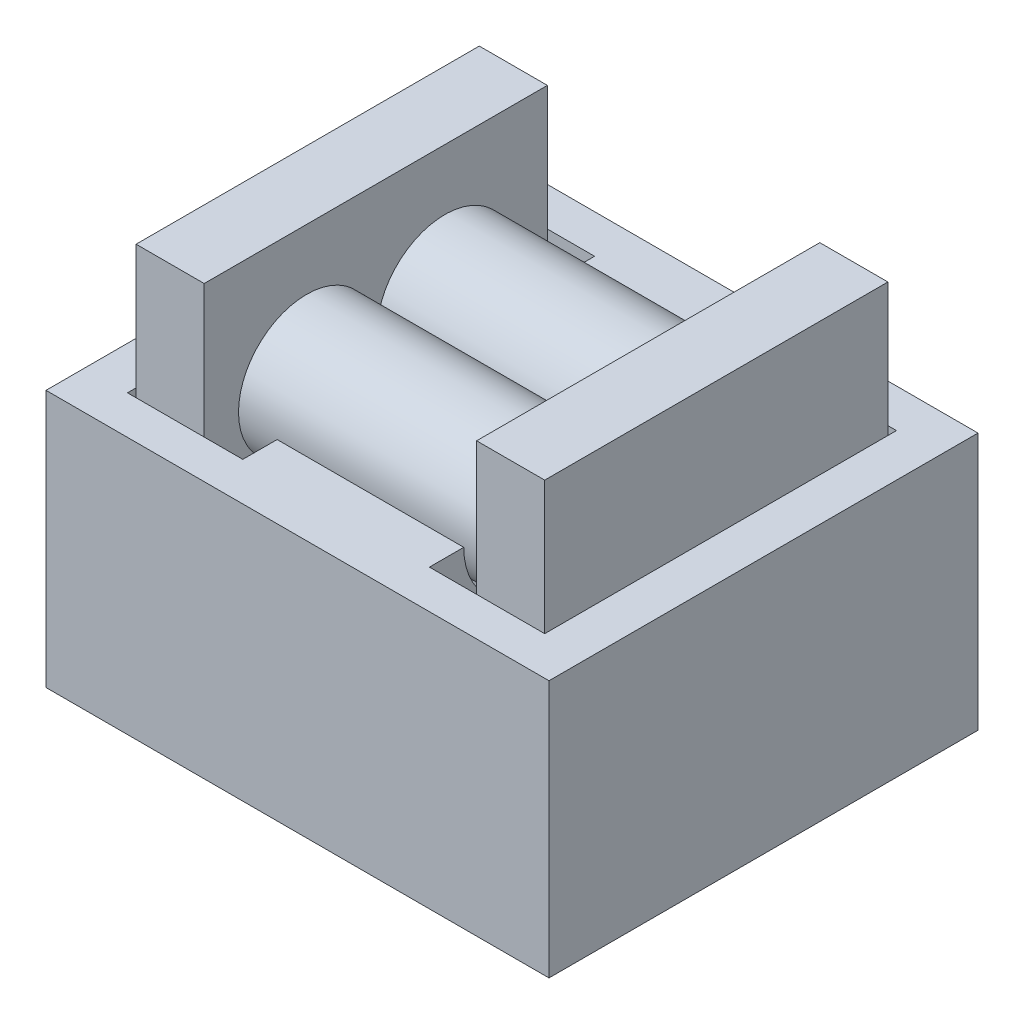
ISO-10303-21;
HEADER;
FILE_DESCRIPTION(('STEP AP214'),'2;1');
FILE_NAME('part.step','',(''),(''),'','','');
FILE_SCHEMA(('AUTOMOTIVE_DESIGN { 1 0 10303 214 1 1 1 1 }'));
ENDSEC;
DATA;
#1=APPLICATION_CONTEXT('core data for automotive mechanical design processes');
#2=APPLICATION_PROTOCOL_DEFINITION('international standard','automotive_design',2000,#1);
#3=PRODUCT_CONTEXT('',#1,'mechanical');
#4=PRODUCT('Part','Part','',(#3));
#5=PRODUCT_RELATED_PRODUCT_CATEGORY('part','',(#4));
#6=PRODUCT_DEFINITION_FORMATION('','',#4);
#7=PRODUCT_DEFINITION_CONTEXT('part definition',#1,'design');
#8=PRODUCT_DEFINITION('design','',#6,#7);
#9=PRODUCT_DEFINITION_SHAPE('','',#8);
#10=(LENGTH_UNIT() NAMED_UNIT(*) SI_UNIT(.MILLI.,.METRE.));
#11=(NAMED_UNIT(*) PLANE_ANGLE_UNIT() SI_UNIT($,.RADIAN.));
#12=(NAMED_UNIT(*) SI_UNIT($,.STERADIAN.) SOLID_ANGLE_UNIT());
#13=UNCERTAINTY_MEASURE_WITH_UNIT(LENGTH_MEASURE(1.E-05),#10,'distance_accuracy_value','');
#14=(GEOMETRIC_REPRESENTATION_CONTEXT(3) GLOBAL_UNCERTAINTY_ASSIGNED_CONTEXT((#13)) GLOBAL_UNIT_ASSIGNED_CONTEXT((#10,
#11,#12)) REPRESENTATION_CONTEXT('',''));
#15=CARTESIAN_POINT('',(0.,0.,0.));
#16=DIRECTION('',(0.,0.,1.));
#17=DIRECTION('',(1.,0.,0.));
#18=AXIS2_PLACEMENT_3D('',#15,#16,#17);
#19=CARTESIAN_POINT('',(-1.,8.,0.));
#20=DIRECTION('',(1.,0.,0.));
#21=DIRECTION('',(0.,0.,-1.));
#22=AXIS2_PLACEMENT_3D('',#19,#20,#21);
#23=PLANE('',#22);
#24=DIRECTION('',(0.,-1.,0.));
#25=VECTOR('',#24,1.);
#26=CARTESIAN_POINT('',(-1.,8.,-8.1));
#27=LINE('',#26,#25);
#28=CARTESIAN_POINT('',(-1.,5.,-8.1));
#29=VERTEX_POINT('',#28);
#30=CARTESIAN_POINT('',(-1.,3.,-8.1));
#31=VERTEX_POINT('',#30);
#32=EDGE_CURVE('E78',#29,#31,#27,.T.);
#33=ORIENTED_EDGE('',*,*,#32,.F.);
#34=DIRECTION('',(0.,0.,-1.));
#35=VECTOR('',#34,1.);
#36=CARTESIAN_POINT('',(-1.,5.,-7.3));
#37=LINE('',#36,#35);
#38=CARTESIAN_POINT('',(-1.,5.,-7.3));
#39=VERTEX_POINT('',#38);
#40=EDGE_CURVE('E355',#39,#29,#37,.T.);
#41=ORIENTED_EDGE('',*,*,#40,.F.);
#42=CARTESIAN_POINT('',(-1.,5.,-5.6125));
#43=DIRECTION('',(1.,0.,0.));
#44=DIRECTION('',(0.,0.,-1.));
#45=AXIS2_PLACEMENT_3D('',#42,#43,#44);
#46=CIRCLE('',#45,1.6875);
#47=CARTESIAN_POINT('',(-1.,4.50250628144669,-4.));
#48=VERTEX_POINT('',#47);
#49=EDGE_CURVE('E367',#48,#39,#46,.T.);
#50=ORIENTED_EDGE('',*,*,#49,.F.);
#51=CARTESIAN_POINT('',(-1.,5.,-2.3875));
#52=DIRECTION('',(1.,0.,0.));
#53=DIRECTION('',(0.,0.,-1.));
#54=AXIS2_PLACEMENT_3D('',#51,#52,#53);
#55=CIRCLE('',#54,1.6875);
#56=CARTESIAN_POINT('',(-1.,5.,-0.699999999999999));
#57=VERTEX_POINT('',#56);
#58=EDGE_CURVE('E372',#57,#48,#55,.T.);
#59=ORIENTED_EDGE('',*,*,#58,.F.);
#60=DIRECTION('',(0.,0.,-1.));
#61=VECTOR('',#60,1.);
#62=CARTESIAN_POINT('',(-1.,5.,-0.699999999999999));
#63=LINE('',#62,#61);
#64=CARTESIAN_POINT('',(-1.,5.,0.0999999999999994));
#65=VERTEX_POINT('',#64);
#66=EDGE_CURVE('E377',#65,#57,#63,.T.);
#67=ORIENTED_EDGE('',*,*,#66,.F.);
#68=DIRECTION('',(0.,1.,0.));
#69=VECTOR('',#68,1.);
#70=CARTESIAN_POINT('',(-1.,8.,0.099999999999999));
#71=LINE('',#70,#69);
#72=CARTESIAN_POINT('',(-1.,3.,0.0999999999999996));
#73=VERTEX_POINT('',#72);
#74=EDGE_CURVE('E260',#73,#65,#71,.T.);
#75=ORIENTED_EDGE('',*,*,#74,.F.);
#76=DIRECTION('',(0.,0.,-1.));
#77=VECTOR('',#76,1.);
#78=CARTESIAN_POINT('',(-1.,3.,0.));
#79=LINE('',#78,#77);
#80=EDGE_CURVE('E343',#73,#31,#79,.T.);
#81=ORIENTED_EDGE('',*,*,#80,.T.);
#82=EDGE_LOOP('',(#33,#41,#50,#59,#67,#75,#81));
#83=FACE_BOUND('',#82,.T.);
#84=ADVANCED_FACE('F55',(#83),#23,.T.);
#85=CARTESIAN_POINT('',(-5.35,0.,0.));
#86=DIRECTION('',(-1.,0.,0.));
#87=DIRECTION('',(0.,0.,1.));
#88=AXIS2_PLACEMENT_3D('',#85,#86,#87);
#89=PLANE('',#88);
#90=DIRECTION('',(0.,1.,0.));
#91=VECTOR('',#90,1.);
#92=CARTESIAN_POINT('',(-5.35,0.,-8.1));
#93=LINE('',#92,#91);
#94=CARTESIAN_POINT('',(-5.35,3.,-8.1));
#95=VERTEX_POINT('',#94);
#96=CARTESIAN_POINT('',(-5.35,5.,-8.1));
#97=VERTEX_POINT('',#96);
#98=EDGE_CURVE('E264',#95,#97,#93,.T.);
#99=ORIENTED_EDGE('',*,*,#98,.F.);
#100=DIRECTION('',(0.,0.,1.));
#101=VECTOR('',#100,1.);
#102=CARTESIAN_POINT('',(-5.35,3.,0.));
#103=LINE('',#102,#101);
#104=CARTESIAN_POINT('',(-5.35,3.,0.0999999999999996));
#105=VERTEX_POINT('',#104);
#106=EDGE_CURVE('E13',#95,#105,#103,.T.);
#107=ORIENTED_EDGE('',*,*,#106,.T.);
#108=DIRECTION('',(0.,-1.,0.));
#109=VECTOR('',#108,1.);
#110=CARTESIAN_POINT('',(-5.35,0.,0.1));
#111=LINE('',#110,#109);
#112=CARTESIAN_POINT('',(-5.35,5.,0.0999999999999994));
#113=VERTEX_POINT('',#112);
#114=EDGE_CURVE('E255',#113,#105,#111,.T.);
#115=ORIENTED_EDGE('',*,*,#114,.F.);
#116=DIRECTION('',(0.,0.,-1.));
#117=VECTOR('',#116,1.);
#118=CARTESIAN_POINT('',(-5.35,5.,-0.699999999999999));
#119=LINE('',#118,#117);
#120=CARTESIAN_POINT('',(-5.35,5.,-0.699999999999999));
#121=VERTEX_POINT('',#120);
#122=EDGE_CURVE('E352',#113,#121,#119,.T.);
#123=ORIENTED_EDGE('',*,*,#122,.T.);
#124=CARTESIAN_POINT('',(-5.35,5.,-2.3875));
#125=DIRECTION('',(-1.,0.,0.));
#126=DIRECTION('',(0.,0.,1.));
#127=AXIS2_PLACEMENT_3D('',#124,#125,#126);
#128=CIRCLE('',#127,1.6875);
#129=CARTESIAN_POINT('',(-5.35,4.50250628144669,-4.));
#130=VERTEX_POINT('',#129);
#131=EDGE_CURVE('E351',#121,#130,#128,.F.);
#132=ORIENTED_EDGE('',*,*,#131,.T.);
#133=CARTESIAN_POINT('',(-5.35,5.,-5.6125));
#134=DIRECTION('',(-1.,0.,0.));
#135=DIRECTION('',(0.,0.,1.));
#136=AXIS2_PLACEMENT_3D('',#133,#134,#135);
#137=CIRCLE('',#136,1.6875);
#138=CARTESIAN_POINT('',(-5.35,5.,-7.3));
#139=VERTEX_POINT('',#138);
#140=EDGE_CURVE('E358',#130,#139,#137,.F.);
#141=ORIENTED_EDGE('',*,*,#140,.T.);
#142=DIRECTION('',(0.,0.,-1.));
#143=VECTOR('',#142,1.);
#144=CARTESIAN_POINT('',(-5.35,5.,-7.3));
#145=LINE('',#144,#143);
#146=EDGE_CURVE('E70',#139,#97,#145,.T.);
#147=ORIENTED_EDGE('',*,*,#146,.T.);
#148=EDGE_LOOP('',(#99,#107,#115,#123,#132,#141,#147));
#149=FACE_BOUND('',#148,.T.);
#150=ADVANCED_FACE('F401',(#149),#89,.T.);
#151=CARTESIAN_POINT('',(11.1803398874989,5.,-7.3));
#152=DIRECTION('',(0.,1.,0.));
#153=DIRECTION('',(0.,0.,1.));
#154=AXIS2_PLACEMENT_3D('',#151,#152,#153);
#155=PLANE('',#154);
#156=ORIENTED_EDGE('',*,*,#40,.T.);
#157=DIRECTION('',(-1.,0.,0.));
#158=VECTOR('',#157,1.);
#159=CARTESIAN_POINT('',(-8.0375,5.00000000000001,-8.1));
#160=LINE('',#159,#158);
#161=CARTESIAN_POINT('',(1.6875,5.00000000000001,-8.1));
#162=VERTEX_POINT('',#161);
#163=EDGE_CURVE('E251',#162,#29,#160,.T.);
#164=ORIENTED_EDGE('',*,*,#163,.F.);
#165=DIRECTION('',(0.,0.,-1.));
#166=VECTOR('',#165,1.);
#167=CARTESIAN_POINT('',(1.6875,5.,0.0999999999999897));
#168=LINE('',#167,#166);
#169=CARTESIAN_POINT('',(1.6875,5.,0.0999999999999996));
#170=VERTEX_POINT('',#169);
#171=EDGE_CURVE('E223',#170,#162,#168,.T.);
#172=ORIENTED_EDGE('',*,*,#171,.F.);
#173=DIRECTION('',(1.,0.,0.));
#174=VECTOR('',#173,1.);
#175=CARTESIAN_POINT('',(-8.0375,5.,0.0999999999999994));
#176=LINE('',#175,#174);
#177=EDGE_CURVE('E227',#65,#170,#176,.T.);
#178=ORIENTED_EDGE('',*,*,#177,.F.);
#179=ORIENTED_EDGE('',*,*,#66,.T.);
#180=DIRECTION('',(-1.,0.,0.));
#181=VECTOR('',#180,1.);
#182=CARTESIAN_POINT('',(11.1803398874989,5.,-0.699999999999999));
#183=LINE('',#182,#181);
#184=EDGE_CURVE('E376',#57,#121,#183,.T.);
#185=ORIENTED_EDGE('',*,*,#184,.T.);
#186=ORIENTED_EDGE('',*,*,#122,.F.);
#187=CARTESIAN_POINT('',(-8.0375,5.,0.0999999999999994));
#188=VERTEX_POINT('',#187);
#189=EDGE_CURVE('E228',#188,#113,#176,.T.);
#190=ORIENTED_EDGE('',*,*,#189,.F.);
#191=DIRECTION('',(0.,0.,1.));
#192=VECTOR('',#191,1.);
#193=CARTESIAN_POINT('',(-8.0375,5.,0.0999999999999897));
#194=LINE('',#193,#192);
#195=CARTESIAN_POINT('',(-8.0375,5.00000000000001,-8.1));
#196=VERTEX_POINT('',#195);
#197=EDGE_CURVE('E232',#196,#188,#194,.T.);
#198=ORIENTED_EDGE('',*,*,#197,.F.);
#199=EDGE_CURVE('E256',#97,#196,#160,.T.);
#200=ORIENTED_EDGE('',*,*,#199,.F.);
#201=ORIENTED_EDGE('',*,*,#146,.F.);
#202=DIRECTION('',(-1.,0.,0.));
#203=VECTOR('',#202,1.);
#204=CARTESIAN_POINT('',(11.1803398874989,5.,-7.3));
#205=LINE('',#204,#203);
#206=EDGE_CURVE('E63',#39,#139,#205,.T.);
#207=ORIENTED_EDGE('',*,*,#206,.F.);
#208=EDGE_LOOP('',(#156,#164,#172,#178,#179,#185,#186,#190,#198,#200,#201,#207));
#209=FACE_BOUND('',#208,.T.);
#210=DIRECTION('',(0.,0.,-1.));
#211=VECTOR('',#210,1.);
#212=CARTESIAN_POINT('',(2.6875,5.,0.999999999999987));
#213=LINE('',#212,#211);
#214=CARTESIAN_POINT('',(2.6875,5.,0.999999999999997));
#215=VERTEX_POINT('',#214);
#216=CARTESIAN_POINT('',(2.6875,5.00000000000001,-9.));
#217=VERTEX_POINT('',#216);
#218=EDGE_CURVE('E236',#215,#217,#213,.T.);
#219=ORIENTED_EDGE('',*,*,#218,.T.);
#220=DIRECTION('',(-1.,0.,0.));
#221=VECTOR('',#220,1.);
#222=CARTESIAN_POINT('',(11.1803398874989,5.,-9.));
#223=LINE('',#222,#221);
#224=CARTESIAN_POINT('',(-9.0375,5.00000000000001,-9.));
#225=VERTEX_POINT('',#224);
#226=EDGE_CURVE('E366',#217,#225,#223,.T.);
#227=ORIENTED_EDGE('',*,*,#226,.T.);
#228=DIRECTION('',(0.,0.,1.));
#229=VECTOR('',#228,1.);
#230=CARTESIAN_POINT('',(-9.0375,5.,0.999999999999987));
#231=LINE('',#230,#229);
#232=CARTESIAN_POINT('',(-9.0375,5.,0.999999999999997));
#233=VERTEX_POINT('',#232);
#234=EDGE_CURVE('E196',#225,#233,#231,.T.);
#235=ORIENTED_EDGE('',*,*,#234,.T.);
#236=DIRECTION('',(-1.,0.,0.));
#237=VECTOR('',#236,1.);
#238=CARTESIAN_POINT('',(11.1803398874989,5.,0.999999999999997));
#239=LINE('',#238,#237);
#240=EDGE_CURVE('E380',#215,#233,#239,.T.);
#241=ORIENTED_EDGE('',*,*,#240,.F.);
#242=EDGE_LOOP('',(#219,#227,#235,#241));
#243=FACE_BOUND('',#242,.T.);
#244=ADVANCED_FACE('F397',(#209,#243),#155,.T.);
#245=CARTESIAN_POINT('',(11.1803398874989,0.,-9.));
#246=DIRECTION('',(0.,0.,-1.));
#247=DIRECTION('',(-1.,0.,0.));
#248=AXIS2_PLACEMENT_3D('',#245,#246,#247);
#249=PLANE('',#248);
#250=DIRECTION('',(0.,-1.,0.));
#251=VECTOR('',#250,1.);
#252=CARTESIAN_POINT('',(-9.03749999999999,3.,-9.));
#253=LINE('',#252,#251);
#254=CARTESIAN_POINT('',(-9.03749999999999,-1.,-9.));
#255=VERTEX_POINT('',#254);
#256=EDGE_CURVE('E189',#225,#255,#253,.T.);
#257=ORIENTED_EDGE('',*,*,#256,.F.);
#258=ORIENTED_EDGE('',*,*,#226,.F.);
#259=DIRECTION('',(0.,-1.,0.));
#260=VECTOR('',#259,1.);
#261=CARTESIAN_POINT('',(2.6875,3.,-9.));
#262=LINE('',#261,#260);
#263=CARTESIAN_POINT('',(2.6875,-1.,-9.));
#264=VERTEX_POINT('',#263);
#265=EDGE_CURVE('E199',#217,#264,#262,.T.);
#266=ORIENTED_EDGE('',*,*,#265,.T.);
#267=DIRECTION('',(1.,0.,0.));
#268=VECTOR('',#267,1.);
#269=CARTESIAN_POINT('',(-9.03749999999999,-1.,-9.));
#270=LINE('',#269,#268);
#271=EDGE_CURVE('E203',#255,#264,#270,.T.);
#272=ORIENTED_EDGE('',*,*,#271,.F.);
#273=EDGE_LOOP('',(#257,#258,#266,#272));
#274=FACE_BOUND('',#273,.T.);
#275=ADVANCED_FACE('F204',(#274),#249,.T.);
#276=CARTESIAN_POINT('',(11.1803398874989,5.,0.999999999999997));
#277=DIRECTION('',(0.,0.,1.));
#278=DIRECTION('',(0.,-1.,0.));
#279=AXIS2_PLACEMENT_3D('',#276,#277,#278);
#280=PLANE('',#279);
#281=DIRECTION('',(0.,-1.,0.));
#282=VECTOR('',#281,1.);
#283=CARTESIAN_POINT('',(2.6875,3.,1.));
#284=LINE('',#283,#282);
#285=CARTESIAN_POINT('',(2.6875,-1.,1.));
#286=VERTEX_POINT('',#285);
#287=EDGE_CURVE('E330',#215,#286,#284,.T.);
#288=ORIENTED_EDGE('',*,*,#287,.F.);
#289=ORIENTED_EDGE('',*,*,#240,.T.);
#290=DIRECTION('',(0.,-1.,0.));
#291=VECTOR('',#290,1.);
#292=CARTESIAN_POINT('',(-9.0375,3.,0.999999999999997));
#293=LINE('',#292,#291);
#294=CARTESIAN_POINT('',(-9.03749999999999,-1.,1.));
#295=VERTEX_POINT('',#294);
#296=EDGE_CURVE('E200',#233,#295,#293,.T.);
#297=ORIENTED_EDGE('',*,*,#296,.T.);
#298=DIRECTION('',(-1.,0.,0.));
#299=VECTOR('',#298,1.);
#300=CARTESIAN_POINT('',(-9.03749999999999,-1.,1.));
#301=LINE('',#300,#299);
#302=EDGE_CURVE('E215',#286,#295,#301,.T.);
#303=ORIENTED_EDGE('',*,*,#302,.F.);
#304=EDGE_LOOP('',(#288,#289,#297,#303));
#305=FACE_BOUND('',#304,.T.);
#306=ADVANCED_FACE('F465',(#305),#280,.T.);
#307=CARTESIAN_POINT('',(11.1803398874989,5.,-2.3875));
#308=DIRECTION('',(-1.,0.,0.));
#309=DIRECTION('',(0.,0.,1.));
#310=AXIS2_PLACEMENT_3D('',#307,#308,#309);
#311=CYLINDRICAL_SURFACE('',#310,1.6875);
#312=ORIENTED_EDGE('',*,*,#184,.F.);
#313=ORIENTED_EDGE('',*,*,#58,.T.);
#314=DIRECTION('',(-1.,0.,0.));
#315=VECTOR('',#314,1.);
#316=CARTESIAN_POINT('',(11.1803398874989,4.50250628144669,-4.));
#317=LINE('',#316,#315);
#318=EDGE_CURVE('E371',#48,#130,#317,.T.);
#319=ORIENTED_EDGE('',*,*,#318,.T.);
#320=ORIENTED_EDGE('',*,*,#131,.F.);
#321=EDGE_LOOP('',(#312,#313,#319,#320));
#322=FACE_BOUND('',#321,.T.);
#323=ADVANCED_FACE('F406',(#322),#311,.F.);
#324=CARTESIAN_POINT('',(11.1803398874989,5.,-5.6125));
#325=DIRECTION('',(-1.,0.,0.));
#326=DIRECTION('',(0.,0.,1.));
#327=AXIS2_PLACEMENT_3D('',#324,#325,#326);
#328=CYLINDRICAL_SURFACE('',#327,1.6875);
#329=ORIENTED_EDGE('',*,*,#318,.F.);
#330=ORIENTED_EDGE('',*,*,#49,.T.);
#331=ORIENTED_EDGE('',*,*,#206,.T.);
#332=ORIENTED_EDGE('',*,*,#140,.F.);
#333=EDGE_LOOP('',(#329,#330,#331,#332));
#334=FACE_BOUND('',#333,.T.);
#335=ADVANCED_FACE('F394',(#334),#328,.F.);
#336=CARTESIAN_POINT('',(-9.03749999999999,3.,-9.));
#337=DIRECTION('',(-1.,0.,0.));
#338=DIRECTION('',(0.,0.,1.));
#339=AXIS2_PLACEMENT_3D('',#336,#337,#338);
#340=PLANE('',#339);
#341=ORIENTED_EDGE('',*,*,#256,.T.);
#342=DIRECTION('',(0.,0.,-1.));
#343=VECTOR('',#342,1.);
#344=CARTESIAN_POINT('',(-9.03749999999999,-1.,-9.));
#345=LINE('',#344,#343);
#346=EDGE_CURVE('E194',#295,#255,#345,.T.);
#347=ORIENTED_EDGE('',*,*,#346,.F.);
#348=ORIENTED_EDGE('',*,*,#296,.F.);
#349=ORIENTED_EDGE('',*,*,#234,.F.);
#350=EDGE_LOOP('',(#341,#347,#348,#349));
#351=FACE_BOUND('',#350,.T.);
#352=ADVANCED_FACE('F191',(#351),#340,.T.);
#353=CARTESIAN_POINT('',(-8.0375,3.,-8.1));
#354=DIRECTION('',(0.,0.,-1.));
#355=DIRECTION('',(0.,1.,0.));
#356=AXIS2_PLACEMENT_3D('',#353,#354,#355);
#357=PLANE('',#356);
#358=DIRECTION('',(1.,0.,0.));
#359=VECTOR('',#358,1.);
#360=CARTESIAN_POINT('',(-8.0375,0.,-8.1));
#361=LINE('',#360,#359);
#362=CARTESIAN_POINT('',(-8.0375,0.,-8.1));
#363=VERTEX_POINT('',#362);
#364=CARTESIAN_POINT('',(-6.25,0.,-8.1));
#365=VERTEX_POINT('',#364);
#366=EDGE_CURVE('E279',#363,#365,#361,.T.);
#367=ORIENTED_EDGE('',*,*,#366,.T.);
#368=DIRECTION('',(0.,-1.,0.));
#369=VECTOR('',#368,1.);
#370=CARTESIAN_POINT('',(-6.25,3.,-8.1));
#371=LINE('',#370,#369);
#372=CARTESIAN_POINT('',(-6.25,3.,-8.1));
#373=VERTEX_POINT('',#372);
#374=EDGE_CURVE('E299',#373,#365,#371,.T.);
#375=ORIENTED_EDGE('',*,*,#374,.F.);
#376=DIRECTION('',(-1.,0.,0.));
#377=VECTOR('',#376,1.);
#378=CARTESIAN_POINT('',(-8.0375,3.,-8.1));
#379=LINE('',#378,#377);
#380=EDGE_CURVE('E247',#95,#373,#379,.T.);
#381=ORIENTED_EDGE('',*,*,#380,.F.);
#382=ORIENTED_EDGE('',*,*,#98,.T.);
#383=ORIENTED_EDGE('',*,*,#199,.T.);
#384=DIRECTION('',(0.,-1.,0.));
#385=VECTOR('',#384,1.);
#386=CARTESIAN_POINT('',(-8.0375,3.,-8.1));
#387=LINE('',#386,#385);
#388=EDGE_CURVE('E274',#196,#363,#387,.T.);
#389=ORIENTED_EDGE('',*,*,#388,.T.);
#390=EDGE_LOOP('',(#367,#375,#381,#382,#383,#389));
#391=FACE_BOUND('',#390,.T.);
#392=ADVANCED_FACE('F423',(#391),#357,.F.);
#393=CARTESIAN_POINT('',(-6.25,3.,-8.1));
#394=DIRECTION('',(1.,0.,0.));
#395=DIRECTION('',(0.,0.,-1.));
#396=AXIS2_PLACEMENT_3D('',#393,#394,#395);
#397=PLANE('',#396);
#398=DIRECTION('',(0.,0.,1.));
#399=VECTOR('',#398,1.);
#400=CARTESIAN_POINT('',(-6.25,0.,-8.1));
#401=LINE('',#400,#399);
#402=CARTESIAN_POINT('',(-6.25,0.,0.0999999999999994));
#403=VERTEX_POINT('',#402);
#404=EDGE_CURVE('E283',#365,#403,#401,.T.);
#405=ORIENTED_EDGE('',*,*,#404,.T.);
#406=DIRECTION('',(0.,-1.,0.));
#407=VECTOR('',#406,1.);
#408=CARTESIAN_POINT('',(-6.25,3.,0.099999999999999));
#409=LINE('',#408,#407);
#410=CARTESIAN_POINT('',(-6.25,3.,0.099999999999999));
#411=VERTEX_POINT('',#410);
#412=EDGE_CURVE('E295',#411,#403,#409,.T.);
#413=ORIENTED_EDGE('',*,*,#412,.F.);
#414=DIRECTION('',(0.,0.,1.));
#415=VECTOR('',#414,1.);
#416=CARTESIAN_POINT('',(-6.25,3.,-8.1));
#417=LINE('',#416,#415);
#418=EDGE_CURVE('E270',#373,#411,#417,.T.);
#419=ORIENTED_EDGE('',*,*,#418,.F.);
#420=ORIENTED_EDGE('',*,*,#374,.T.);
#421=EDGE_LOOP('',(#405,#413,#419,#420));
#422=FACE_BOUND('',#421,.T.);
#423=ADVANCED_FACE('F433',(#422),#397,.F.);
#424=CARTESIAN_POINT('',(-8.0375,3.,0.0999999999999996));
#425=DIRECTION('',(0.,0.,1.));
#426=DIRECTION('',(1.,0.,0.));
#427=AXIS2_PLACEMENT_3D('',#424,#425,#426);
#428=PLANE('',#427);
#429=DIRECTION('',(-1.,0.,0.));
#430=VECTOR('',#429,1.);
#431=CARTESIAN_POINT('',(-8.0375,0.,0.1));
#432=LINE('',#431,#430);
#433=CARTESIAN_POINT('',(-8.0375,0.,0.1));
#434=VERTEX_POINT('',#433);
#435=EDGE_CURVE('E275',#403,#434,#432,.T.);
#436=ORIENTED_EDGE('',*,*,#435,.T.);
#437=DIRECTION('',(0.,-1.,0.));
#438=VECTOR('',#437,1.);
#439=CARTESIAN_POINT('',(-8.0375,3.,0.0999999999999996));
#440=LINE('',#439,#438);
#441=EDGE_CURVE('E290',#188,#434,#440,.T.);
#442=ORIENTED_EDGE('',*,*,#441,.F.);
#443=ORIENTED_EDGE('',*,*,#189,.T.);
#444=ORIENTED_EDGE('',*,*,#114,.T.);
#445=DIRECTION('',(1.,0.,0.));
#446=VECTOR('',#445,1.);
#447=CARTESIAN_POINT('',(-8.0375,3.,0.0999999999999996));
#448=LINE('',#447,#446);
#449=EDGE_CURVE('E246',#411,#105,#448,.T.);
#450=ORIENTED_EDGE('',*,*,#449,.F.);
#451=ORIENTED_EDGE('',*,*,#412,.T.);
#452=EDGE_LOOP('',(#436,#442,#443,#444,#450,#451));
#453=FACE_BOUND('',#452,.T.);
#454=ADVANCED_FACE('F439',(#453),#428,.F.);
#455=CARTESIAN_POINT('',(-8.0375,3.,-8.1));
#456=DIRECTION('',(-1.,0.,0.));
#457=DIRECTION('',(0.,0.,1.));
#458=AXIS2_PLACEMENT_3D('',#455,#456,#457);
#459=PLANE('',#458);
#460=DIRECTION('',(0.,0.,-1.));
#461=VECTOR('',#460,1.);
#462=CARTESIAN_POINT('',(-8.0375,0.,-8.1));
#463=LINE('',#462,#461);
#464=EDGE_CURVE('E269',#434,#363,#463,.T.);
#465=ORIENTED_EDGE('',*,*,#464,.T.);
#466=ORIENTED_EDGE('',*,*,#388,.F.);
#467=ORIENTED_EDGE('',*,*,#197,.T.);
#468=ORIENTED_EDGE('',*,*,#441,.T.);
#469=EDGE_LOOP('',(#465,#466,#467,#468));
#470=FACE_BOUND('',#469,.T.);
#471=ADVANCED_FACE('F427',(#470),#459,.F.);
#472=CARTESIAN_POINT('',(0.,3.,0.));
#473=DIRECTION('',(0.,-1.,0.));
#474=DIRECTION('',(0.,0.,-1.));
#475=AXIS2_PLACEMENT_3D('',#472,#473,#474);
#476=PLANE('',#475);
#477=ORIENTED_EDGE('',*,*,#106,.F.);
#478=ORIENTED_EDGE('',*,*,#380,.T.);
#479=ORIENTED_EDGE('',*,*,#418,.T.);
#480=ORIENTED_EDGE('',*,*,#449,.T.);
#481=EDGE_LOOP('',(#477,#478,#479,#480));
#482=FACE_BOUND('',#481,.T.);
#483=ADVANCED_FACE('F437',(#482),#476,.F.);
#484=DIRECTION('',(0.,0.,-1.));
#485=VECTOR('',#484,1.);
#486=CARTESIAN_POINT('',(-0.1,3.,-8.1));
#487=LINE('',#486,#485);
#488=CARTESIAN_POINT('',(-0.0999999999999994,3.,0.0999999999999996));
#489=VERTEX_POINT('',#488);
#490=CARTESIAN_POINT('',(-0.1,3.,-8.1));
#491=VERTEX_POINT('',#490);
#492=EDGE_CURVE('E306',#489,#491,#487,.T.);
#493=ORIENTED_EDGE('',*,*,#492,.T.);
#494=EDGE_CURVE('E250',#491,#31,#379,.T.);
#495=ORIENTED_EDGE('',*,*,#494,.T.);
#496=ORIENTED_EDGE('',*,*,#80,.F.);
#497=EDGE_CURVE('E242',#73,#489,#448,.T.);
#498=ORIENTED_EDGE('',*,*,#497,.T.);
#499=EDGE_LOOP('',(#493,#495,#496,#498));
#500=FACE_BOUND('',#499,.T.);
#501=ADVANCED_FACE('F516',(#500),#476,.F.);
#502=CARTESIAN_POINT('',(2.6875,3.,-9.));
#503=DIRECTION('',(1.,0.,0.));
#504=DIRECTION('',(0.,0.,-1.));
#505=AXIS2_PLACEMENT_3D('',#502,#503,#504);
#506=PLANE('',#505);
#507=ORIENTED_EDGE('',*,*,#287,.T.);
#508=DIRECTION('',(0.,0.,1.));
#509=VECTOR('',#508,1.);
#510=CARTESIAN_POINT('',(2.6875,-1.,-9.));
#511=LINE('',#510,#509);
#512=EDGE_CURVE('E210',#264,#286,#511,.T.);
#513=ORIENTED_EDGE('',*,*,#512,.F.);
#514=ORIENTED_EDGE('',*,*,#265,.F.);
#515=ORIENTED_EDGE('',*,*,#218,.F.);
#516=EDGE_LOOP('',(#507,#513,#514,#515));
#517=FACE_BOUND('',#516,.T.);
#518=ADVANCED_FACE('F459',(#517),#506,.T.);
#519=CARTESIAN_POINT('',(1.6875,3.,0.0999999999999996));
#520=DIRECTION('',(1.,0.,0.));
#521=DIRECTION('',(0.,0.,-1.));
#522=AXIS2_PLACEMENT_3D('',#519,#520,#521);
#523=PLANE('',#522);
#524=DIRECTION('',(0.,0.,1.));
#525=VECTOR('',#524,1.);
#526=CARTESIAN_POINT('',(1.6875,0.,0.1));
#527=LINE('',#526,#525);
#528=CARTESIAN_POINT('',(1.6875,0.,-8.1));
#529=VERTEX_POINT('',#528);
#530=CARTESIAN_POINT('',(1.6875,0.,0.1));
#531=VERTEX_POINT('',#530);
#532=EDGE_CURVE('E294',#529,#531,#527,.T.);
#533=ORIENTED_EDGE('',*,*,#532,.T.);
#534=DIRECTION('',(0.,-1.,0.));
#535=VECTOR('',#534,1.);
#536=CARTESIAN_POINT('',(1.6875,3.,0.0999999999999996));
#537=LINE('',#536,#535);
#538=EDGE_CURVE('E310',#170,#531,#537,.T.);
#539=ORIENTED_EDGE('',*,*,#538,.F.);
#540=ORIENTED_EDGE('',*,*,#171,.T.);
#541=DIRECTION('',(0.,-1.,0.));
#542=VECTOR('',#541,1.);
#543=CARTESIAN_POINT('',(1.6875,3.,-8.1));
#544=LINE('',#543,#542);
#545=EDGE_CURVE('E326',#162,#529,#544,.T.);
#546=ORIENTED_EDGE('',*,*,#545,.T.);
#547=EDGE_LOOP('',(#533,#539,#540,#546));
#548=FACE_BOUND('',#547,.T.);
#549=ADVANCED_FACE('F414',(#548),#523,.F.);
#550=CARTESIAN_POINT('',(1.6875,3.,-8.1));
#551=DIRECTION('',(0.,0.,-1.));
#552=DIRECTION('',(0.,1.,0.));
#553=AXIS2_PLACEMENT_3D('',#550,#551,#552);
#554=PLANE('',#553);
#555=DIRECTION('',(1.,0.,0.));
#556=VECTOR('',#555,1.);
#557=CARTESIAN_POINT('',(1.6875,0.,-8.1));
#558=LINE('',#557,#556);
#559=CARTESIAN_POINT('',(-0.1,0.,-8.1));
#560=VERTEX_POINT('',#559);
#561=EDGE_CURVE('E311',#560,#529,#558,.T.);
#562=ORIENTED_EDGE('',*,*,#561,.T.);
#563=ORIENTED_EDGE('',*,*,#545,.F.);
#564=ORIENTED_EDGE('',*,*,#163,.T.);
#565=ORIENTED_EDGE('',*,*,#32,.T.);
#566=ORIENTED_EDGE('',*,*,#494,.F.);
#567=DIRECTION('',(0.,-1.,0.));
#568=VECTOR('',#567,1.);
#569=CARTESIAN_POINT('',(-0.1,3.,-8.1));
#570=LINE('',#569,#568);
#571=EDGE_CURVE('E331',#491,#560,#570,.T.);
#572=ORIENTED_EDGE('',*,*,#571,.T.);
#573=EDGE_LOOP('',(#562,#563,#564,#565,#566,#572));
#574=FACE_BOUND('',#573,.T.);
#575=ADVANCED_FACE('F411',(#574),#554,.F.);
#576=CARTESIAN_POINT('',(-0.1,3.,-8.1));
#577=DIRECTION('',(-1.,0.,0.));
#578=DIRECTION('',(0.,0.,1.));
#579=AXIS2_PLACEMENT_3D('',#576,#577,#578);
#580=PLANE('',#579);
#581=DIRECTION('',(0.,0.,-1.));
#582=VECTOR('',#581,1.);
#583=CARTESIAN_POINT('',(-0.1,0.,-8.1));
#584=LINE('',#583,#582);
#585=CARTESIAN_POINT('',(-0.1,0.,0.1));
#586=VERTEX_POINT('',#585);
#587=EDGE_CURVE('E319',#586,#560,#584,.T.);
#588=ORIENTED_EDGE('',*,*,#587,.T.);
#589=ORIENTED_EDGE('',*,*,#571,.F.);
#590=ORIENTED_EDGE('',*,*,#492,.F.);
#591=DIRECTION('',(0.,-1.,0.));
#592=VECTOR('',#591,1.);
#593=CARTESIAN_POINT('',(-0.1,3.,0.0999999999999996));
#594=LINE('',#593,#592);
#595=EDGE_CURVE('E335',#489,#586,#594,.T.);
#596=ORIENTED_EDGE('',*,*,#595,.T.);
#597=EDGE_LOOP('',(#588,#589,#590,#596));
#598=FACE_BOUND('',#597,.T.);
#599=ADVANCED_FACE('F532',(#598),#580,.F.);
#600=CARTESIAN_POINT('',(-0.1,3.,0.0999999999999996));
#601=DIRECTION('',(0.,0.,1.));
#602=DIRECTION('',(0.,-1.,0.));
#603=AXIS2_PLACEMENT_3D('',#600,#601,#602);
#604=PLANE('',#603);
#605=DIRECTION('',(-1.,0.,0.));
#606=VECTOR('',#605,1.);
#607=CARTESIAN_POINT('',(-0.1,0.,0.1));
#608=LINE('',#607,#606);
#609=EDGE_CURVE('E315',#531,#586,#608,.T.);
#610=ORIENTED_EDGE('',*,*,#609,.T.);
#611=ORIENTED_EDGE('',*,*,#595,.F.);
#612=ORIENTED_EDGE('',*,*,#497,.F.);
#613=ORIENTED_EDGE('',*,*,#74,.T.);
#614=ORIENTED_EDGE('',*,*,#177,.T.);
#615=ORIENTED_EDGE('',*,*,#538,.T.);
#616=EDGE_LOOP('',(#610,#611,#612,#613,#614,#615));
#617=FACE_BOUND('',#616,.T.);
#618=ADVANCED_FACE('F540',(#617),#604,.F.);
#619=CARTESIAN_POINT('',(0.,0.,0.));
#620=DIRECTION('',(0.,1.,0.));
#621=DIRECTION('',(0.,0.,1.));
#622=AXIS2_PLACEMENT_3D('',#619,#620,#621);
#623=PLANE('',#622);
#624=ORIENTED_EDGE('',*,*,#532,.F.);
#625=ORIENTED_EDGE('',*,*,#561,.F.);
#626=ORIENTED_EDGE('',*,*,#587,.F.);
#627=ORIENTED_EDGE('',*,*,#609,.F.);
#628=EDGE_LOOP('',(#624,#625,#626,#627));
#629=FACE_BOUND('',#628,.T.);
#630=ADVANCED_FACE('F549',(#629),#623,.T.);
#631=ORIENTED_EDGE('',*,*,#464,.F.);
#632=ORIENTED_EDGE('',*,*,#435,.F.);
#633=ORIENTED_EDGE('',*,*,#404,.F.);
#634=ORIENTED_EDGE('',*,*,#366,.F.);
#635=EDGE_LOOP('',(#631,#632,#633,#634));
#636=FACE_BOUND('',#635,.T.);
#637=ADVANCED_FACE('F429',(#636),#623,.T.);
#638=CARTESIAN_POINT('',(0.,-1.,0.));
#639=DIRECTION('',(0.,1.,0.));
#640=DIRECTION('',(0.,0.,1.));
#641=AXIS2_PLACEMENT_3D('',#638,#639,#640);
#642=PLANE('',#641);
#643=ORIENTED_EDGE('',*,*,#346,.T.);
#644=ORIENTED_EDGE('',*,*,#271,.T.);
#645=ORIENTED_EDGE('',*,*,#512,.T.);
#646=ORIENTED_EDGE('',*,*,#302,.T.);
#647=EDGE_LOOP('',(#643,#644,#645,#646));
#648=FACE_BOUND('',#647,.T.);
#649=ADVANCED_FACE('F213',(#648),#642,.F.);
#650=CLOSED_SHELL('',(#84,#150,#244,#275,#306,#323,#335,#352,#392,#423,#454,#471,#483,#501,#518,
#549,#575,#599,#618,#630,#637,#649));
#651=MANIFOLD_SOLID_BREP('B2',#650);
#652=CARTESIAN_POINT('',(0.,8.,0.));
#653=DIRECTION('',(1.,0.,0.));
#654=DIRECTION('',(0.,0.,-1.));
#655=AXIS2_PLACEMENT_3D('',#652,#653,#654);
#656=PLANE('',#655);
#657=CARTESIAN_POINT('',(0.,5.,-2.3875));
#658=DIRECTION('',(1.,0.,0.));
#659=DIRECTION('',(0.,0.,-1.));
#660=AXIS2_PLACEMENT_3D('',#657,#658,#659);
#661=CIRCLE('',#660,1.5875);
#662=CARTESIAN_POINT('',(0.,5.,-3.975));
#663=VERTEX_POINT('',#662);
#664=EDGE_CURVE('E53',#663,#663,#661,.F.);
#665=ORIENTED_EDGE('',*,*,#664,.F.);
#666=EDGE_LOOP('',(#665));
#667=FACE_BOUND('',#666,.T.);
#668=CARTESIAN_POINT('',(0.,5.,-5.6125));
#669=DIRECTION('',(-1.,0.,0.));
#670=DIRECTION('',(0.,0.,1.));
#671=AXIS2_PLACEMENT_3D('',#668,#669,#670);
#672=CIRCLE('',#671,1.5875);
#673=CARTESIAN_POINT('',(0.,5.,-4.025));
#674=VERTEX_POINT('',#673);
#675=EDGE_CURVE('E708',#674,#674,#672,.T.);
#676=ORIENTED_EDGE('',*,*,#675,.F.);
#677=EDGE_LOOP('',(#676));
#678=FACE_BOUND('',#677,.T.);
#679=DIRECTION('',(0.,0.,1.));
#680=VECTOR('',#679,1.);
#681=CARTESIAN_POINT('',(0.,0.,0.));
#682=LINE('',#681,#680);
#683=CARTESIAN_POINT('',(0.,0.,-8.));
#684=VERTEX_POINT('',#683);
#685=CARTESIAN_POINT('',(0.,0.,0.));
#686=VERTEX_POINT('',#685);
#687=EDGE_CURVE('E811',#684,#686,#682,.T.);
#688=ORIENTED_EDGE('',*,*,#687,.T.);
#689=DIRECTION('',(0.,-1.,0.));
#690=VECTOR('',#689,1.);
#691=CARTESIAN_POINT('',(0.,8.,0.));
#692=LINE('',#691,#690);
#693=CARTESIAN_POINT('',(0.,8.,0.));
#694=VERTEX_POINT('',#693);
#695=EDGE_CURVE('E814',#694,#686,#692,.T.);
#696=ORIENTED_EDGE('',*,*,#695,.F.);
#697=DIRECTION('',(0.,0.,1.));
#698=VECTOR('',#697,1.);
#699=CARTESIAN_POINT('',(0.,8.,0.));
#700=LINE('',#699,#698);
#701=CARTESIAN_POINT('',(0.,8.,-8.));
#702=VERTEX_POINT('',#701);
#703=EDGE_CURVE('E815',#702,#694,#700,.T.);
#704=ORIENTED_EDGE('',*,*,#703,.F.);
#705=DIRECTION('',(0.,-1.,0.));
#706=VECTOR('',#705,1.);
#707=CARTESIAN_POINT('',(0.,8.,-8.));
#708=LINE('',#707,#706);
#709=EDGE_CURVE('E821',#702,#684,#708,.T.);
#710=ORIENTED_EDGE('',*,*,#709,.T.);
#711=EDGE_LOOP('',(#688,#696,#704,#710));
#712=FACE_BOUND('',#711,.T.);
#713=ADVANCED_FACE('F700',(#667,#678,#712),#656,.F.);
#714=CARTESIAN_POINT('',(0.,8.,0.));
#715=DIRECTION('',(0.,0.,-1.));
#716=DIRECTION('',(-1.,0.,0.));
#717=AXIS2_PLACEMENT_3D('',#714,#715,#716);
#718=PLANE('',#717);
#719=DIRECTION('',(1.,0.,0.));
#720=VECTOR('',#719,1.);
#721=CARTESIAN_POINT('',(0.,0.,0.));
#722=LINE('',#721,#720);
#723=CARTESIAN_POINT('',(1.5875,0.,0.));
#724=VERTEX_POINT('',#723);
#725=EDGE_CURVE('E824',#686,#724,#722,.T.);
#726=ORIENTED_EDGE('',*,*,#725,.T.);
#727=DIRECTION('',(0.,-1.,0.));
#728=VECTOR('',#727,1.);
#729=CARTESIAN_POINT('',(1.5875,8.,0.));
#730=LINE('',#729,#728);
#731=CARTESIAN_POINT('',(1.5875,8.,0.));
#732=VERTEX_POINT('',#731);
#733=EDGE_CURVE('E831',#732,#724,#730,.T.);
#734=ORIENTED_EDGE('',*,*,#733,.F.);
#735=DIRECTION('',(1.,0.,0.));
#736=VECTOR('',#735,1.);
#737=CARTESIAN_POINT('',(0.,8.,0.));
#738=LINE('',#737,#736);
#739=EDGE_CURVE('E748',#694,#732,#738,.T.);
#740=ORIENTED_EDGE('',*,*,#739,.F.);
#741=ORIENTED_EDGE('',*,*,#695,.T.);
#742=EDGE_LOOP('',(#726,#734,#740,#741));
#743=FACE_BOUND('',#742,.T.);
#744=ADVANCED_FACE('F833',(#743),#718,.F.);
#745=CARTESIAN_POINT('',(1.5875,8.,0.));
#746=DIRECTION('',(-1.,0.,0.));
#747=DIRECTION('',(0.,0.,1.));
#748=AXIS2_PLACEMENT_3D('',#745,#746,#747);
#749=PLANE('',#748);
#750=DIRECTION('',(0.,0.,-1.));
#751=VECTOR('',#750,1.);
#752=CARTESIAN_POINT('',(1.5875,0.,0.));
#753=LINE('',#752,#751);
#754=CARTESIAN_POINT('',(1.5875,0.,-8.));
#755=VERTEX_POINT('',#754);
#756=EDGE_CURVE('E734',#724,#755,#753,.T.);
#757=ORIENTED_EDGE('',*,*,#756,.T.);
#758=DIRECTION('',(0.,-1.,0.));
#759=VECTOR('',#758,1.);
#760=CARTESIAN_POINT('',(1.5875,8.,-8.));
#761=LINE('',#760,#759);
#762=CARTESIAN_POINT('',(1.5875,8.,-8.));
#763=VERTEX_POINT('',#762);
#764=EDGE_CURVE('E829',#763,#755,#761,.T.);
#765=ORIENTED_EDGE('',*,*,#764,.F.);
#766=DIRECTION('',(0.,0.,-1.));
#767=VECTOR('',#766,1.);
#768=CARTESIAN_POINT('',(1.5875,8.,0.));
#769=LINE('',#768,#767);
#770=EDGE_CURVE('E818',#732,#763,#769,.T.);
#771=ORIENTED_EDGE('',*,*,#770,.F.);
#772=ORIENTED_EDGE('',*,*,#733,.T.);
#773=EDGE_LOOP('',(#757,#765,#771,#772));
#774=FACE_BOUND('',#773,.T.);
#775=ADVANCED_FACE('F858',(#774),#749,.F.);
#776=CARTESIAN_POINT('',(0.,8.,-8.));
#777=DIRECTION('',(0.,0.,1.));
#778=DIRECTION('',(1.,0.,0.));
#779=AXIS2_PLACEMENT_3D('',#776,#777,#778);
#780=PLANE('',#779);
#781=DIRECTION('',(-1.,0.,0.));
#782=VECTOR('',#781,1.);
#783=CARTESIAN_POINT('',(0.,0.,-8.));
#784=LINE('',#783,#782);
#785=EDGE_CURVE('E740',#755,#684,#784,.T.);
#786=ORIENTED_EDGE('',*,*,#785,.T.);
#787=ORIENTED_EDGE('',*,*,#709,.F.);
#788=DIRECTION('',(-1.,0.,0.));
#789=VECTOR('',#788,1.);
#790=CARTESIAN_POINT('',(0.,8.,-8.));
#791=LINE('',#790,#789);
#792=EDGE_CURVE('E716',#763,#702,#791,.T.);
#793=ORIENTED_EDGE('',*,*,#792,.F.);
#794=ORIENTED_EDGE('',*,*,#764,.T.);
#795=EDGE_LOOP('',(#786,#787,#793,#794));
#796=FACE_BOUND('',#795,.T.);
#797=ADVANCED_FACE('F850',(#796),#780,.F.);
#798=CARTESIAN_POINT('',(0.,8.,0.));
#799=DIRECTION('',(0.,-1.,0.));
#800=DIRECTION('',(0.,0.,-1.));
#801=AXIS2_PLACEMENT_3D('',#798,#799,#800);
#802=PLANE('',#801);
#803=ORIENTED_EDGE('',*,*,#703,.T.);
#804=ORIENTED_EDGE('',*,*,#739,.T.);
#805=ORIENTED_EDGE('',*,*,#770,.T.);
#806=ORIENTED_EDGE('',*,*,#792,.T.);
#807=EDGE_LOOP('',(#803,#804,#805,#806));
#808=FACE_BOUND('',#807,.T.);
#809=ADVANCED_FACE('F841',(#808),#802,.F.);
#810=CARTESIAN_POINT('',(0.,0.,0.));
#811=DIRECTION('',(0.,-1.,0.));
#812=DIRECTION('',(0.,0.,-1.));
#813=AXIS2_PLACEMENT_3D('',#810,#811,#812);
#814=PLANE('',#813);
#815=ORIENTED_EDGE('',*,*,#687,.F.);
#816=ORIENTED_EDGE('',*,*,#785,.F.);
#817=ORIENTED_EDGE('',*,*,#756,.F.);
#818=ORIENTED_EDGE('',*,*,#725,.F.);
#819=EDGE_LOOP('',(#815,#816,#817,#818));
#820=FACE_BOUND('',#819,.T.);
#821=ADVANCED_FACE('F838',(#820),#814,.T.);
#822=CARTESIAN_POINT('',(-6.35,5.,-5.6125));
#823=DIRECTION('',(1.,0.,0.));
#824=DIRECTION('',(0.,0.,-1.));
#825=AXIS2_PLACEMENT_3D('',#822,#823,#824);
#826=CYLINDRICAL_SURFACE('',#825,1.5875);
#827=CARTESIAN_POINT('',(-6.35,5.,-5.6125));
#828=DIRECTION('',(-1.,0.,0.));
#829=DIRECTION('',(0.,0.,1.));
#830=AXIS2_PLACEMENT_3D('',#827,#828,#829);
#831=CIRCLE('',#830,1.5875);
#832=CARTESIAN_POINT('',(-6.35,5.,-4.025));
#833=VERTEX_POINT('',#832);
#834=EDGE_CURVE('E803',#833,#833,#831,.T.);
#835=ORIENTED_EDGE('',*,*,#834,.F.);
#836=EDGE_LOOP('',(#835));
#837=FACE_BOUND('',#836,.T.);
#838=ORIENTED_EDGE('',*,*,#675,.T.);
#839=EDGE_LOOP('',(#838));
#840=FACE_BOUND('',#839,.T.);
#841=ADVANCED_FACE('F840',(#837,#840),#826,.T.);
#842=CARTESIAN_POINT('',(-6.35,5.,-2.3875));
#843=DIRECTION('',(1.,0.,0.));
#844=DIRECTION('',(0.,0.,-1.));
#845=AXIS2_PLACEMENT_3D('',#842,#843,#844);
#846=CYLINDRICAL_SURFACE('',#845,1.5875);
#847=CARTESIAN_POINT('',(-6.35,5.,-2.3875));
#848=DIRECTION('',(-1.,0.,0.));
#849=DIRECTION('',(0.,0.,1.));
#850=AXIS2_PLACEMENT_3D('',#847,#848,#849);
#851=CIRCLE('',#850,1.5875);
#852=CARTESIAN_POINT('',(-6.35,5.,-0.799999999999999));
#853=VERTEX_POINT('',#852);
#854=EDGE_CURVE('E800',#853,#853,#851,.T.);
#855=ORIENTED_EDGE('',*,*,#854,.F.);
#856=EDGE_LOOP('',(#855));
#857=FACE_BOUND('',#856,.T.);
#858=ORIENTED_EDGE('',*,*,#664,.T.);
#859=EDGE_LOOP('',(#858));
#860=FACE_BOUND('',#859,.T.);
#861=ADVANCED_FACE('F847',(#857,#860),#846,.T.);
#862=CARTESIAN_POINT('',(-7.9375,8.,-8.));
#863=DIRECTION('',(0.,0.,1.));
#864=DIRECTION('',(1.,0.,0.));
#865=AXIS2_PLACEMENT_3D('',#862,#863,#864);
#866=PLANE('',#865);
#867=DIRECTION('',(0.,-1.,0.));
#868=VECTOR('',#867,1.);
#869=CARTESIAN_POINT('',(-6.35,8.,-8.));
#870=LINE('',#869,#868);
#871=CARTESIAN_POINT('',(-6.35,8.,-8.));
#872=VERTEX_POINT('',#871);
#873=CARTESIAN_POINT('',(-6.35,0.,-8.));
#874=VERTEX_POINT('',#873);
#875=EDGE_CURVE('E799',#872,#874,#870,.T.);
#876=ORIENTED_EDGE('',*,*,#875,.T.);
#877=DIRECTION('',(1.,0.,0.));
#878=VECTOR('',#877,1.);
#879=CARTESIAN_POINT('',(-7.9375,0.,-8.));
#880=LINE('',#879,#878);
#881=CARTESIAN_POINT('',(-7.9375,0.,-8.));
#882=VERTEX_POINT('',#881);
#883=EDGE_CURVE('E779',#882,#874,#880,.T.);
#884=ORIENTED_EDGE('',*,*,#883,.F.);
#885=DIRECTION('',(0.,-1.,0.));
#886=VECTOR('',#885,1.);
#887=CARTESIAN_POINT('',(-7.9375,8.,-8.));
#888=LINE('',#887,#886);
#889=CARTESIAN_POINT('',(-7.9375,8.,-8.));
#890=VERTEX_POINT('',#889);
#891=EDGE_CURVE('E786',#890,#882,#888,.T.);
#892=ORIENTED_EDGE('',*,*,#891,.F.);
#893=DIRECTION('',(1.,0.,0.));
#894=VECTOR('',#893,1.);
#895=CARTESIAN_POINT('',(-7.9375,8.,-8.));
#896=LINE('',#895,#894);
#897=EDGE_CURVE('E999',#890,#872,#896,.T.);
#898=ORIENTED_EDGE('',*,*,#897,.T.);
#899=EDGE_LOOP('',(#876,#884,#892,#898));
#900=FACE_BOUND('',#899,.T.);
#901=ADVANCED_FACE('F797',(#900),#866,.F.);
#902=CARTESIAN_POINT('',(-7.9375,0.,-8.));
#903=DIRECTION('',(0.,1.,0.));
#904=DIRECTION('',(0.,0.,1.));
#905=AXIS2_PLACEMENT_3D('',#902,#903,#904);
#906=PLANE('',#905);
#907=DIRECTION('',(0.,0.,1.));
#908=VECTOR('',#907,1.);
#909=CARTESIAN_POINT('',(-6.35,0.,-8.));
#910=LINE('',#909,#908);
#911=CARTESIAN_POINT('',(-6.35,0.,0.));
#912=VERTEX_POINT('',#911);
#913=EDGE_CURVE('E990',#874,#912,#910,.T.);
#914=ORIENTED_EDGE('',*,*,#913,.T.);
#915=DIRECTION('',(1.,0.,0.));
#916=VECTOR('',#915,1.);
#917=CARTESIAN_POINT('',(-7.9375,0.,0.));
#918=LINE('',#917,#916);
#919=CARTESIAN_POINT('',(-7.9375,0.,0.));
#920=VERTEX_POINT('',#919);
#921=EDGE_CURVE('E782',#920,#912,#918,.T.);
#922=ORIENTED_EDGE('',*,*,#921,.F.);
#923=DIRECTION('',(0.,0.,1.));
#924=VECTOR('',#923,1.);
#925=CARTESIAN_POINT('',(-7.9375,0.,-8.));
#926=LINE('',#925,#924);
#927=EDGE_CURVE('E775',#882,#920,#926,.T.);
#928=ORIENTED_EDGE('',*,*,#927,.F.);
#929=ORIENTED_EDGE('',*,*,#883,.T.);
#930=EDGE_LOOP('',(#914,#922,#928,#929));
#931=FACE_BOUND('',#930,.T.);
#932=ADVANCED_FACE('F777',(#931),#906,.F.);
#933=CARTESIAN_POINT('',(-7.9375,8.,0.));
#934=DIRECTION('',(0.,0.,-1.));
#935=DIRECTION('',(-1.,0.,0.));
#936=AXIS2_PLACEMENT_3D('',#933,#934,#935);
#937=PLANE('',#936);
#938=DIRECTION('',(0.,1.,0.));
#939=VECTOR('',#938,1.);
#940=CARTESIAN_POINT('',(-6.35,8.,0.));
#941=LINE('',#940,#939);
#942=CARTESIAN_POINT('',(-6.35,8.,0.));
#943=VERTEX_POINT('',#942);
#944=EDGE_CURVE('E992',#912,#943,#941,.T.);
#945=ORIENTED_EDGE('',*,*,#944,.T.);
#946=DIRECTION('',(1.,0.,0.));
#947=VECTOR('',#946,1.);
#948=CARTESIAN_POINT('',(-7.9375,8.,0.));
#949=LINE('',#948,#947);
#950=CARTESIAN_POINT('',(-7.9375,8.,0.));
#951=VERTEX_POINT('',#950);
#952=EDGE_CURVE('E805',#951,#943,#949,.T.);
#953=ORIENTED_EDGE('',*,*,#952,.F.);
#954=DIRECTION('',(0.,1.,0.));
#955=VECTOR('',#954,1.);
#956=CARTESIAN_POINT('',(-7.9375,8.,0.));
#957=LINE('',#956,#955);
#958=EDGE_CURVE('E785',#920,#951,#957,.T.);
#959=ORIENTED_EDGE('',*,*,#958,.F.);
#960=ORIENTED_EDGE('',*,*,#921,.T.);
#961=EDGE_LOOP('',(#945,#953,#959,#960));
#962=FACE_BOUND('',#961,.T.);
#963=ADVANCED_FACE('F875',(#962),#937,.F.);
#964=CARTESIAN_POINT('',(-7.9375,8.,-8.));
#965=DIRECTION('',(0.,-1.,0.));
#966=DIRECTION('',(0.,0.,-1.));
#967=AXIS2_PLACEMENT_3D('',#964,#965,#966);
#968=PLANE('',#967);
#969=DIRECTION('',(0.,0.,-1.));
#970=VECTOR('',#969,1.);
#971=CARTESIAN_POINT('',(-6.35,8.,-8.));
#972=LINE('',#971,#970);
#973=EDGE_CURVE('E795',#943,#872,#972,.T.);
#974=ORIENTED_EDGE('',*,*,#973,.T.);
#975=ORIENTED_EDGE('',*,*,#897,.F.);
#976=DIRECTION('',(0.,0.,-1.));
#977=VECTOR('',#976,1.);
#978=CARTESIAN_POINT('',(-7.9375,8.,-8.));
#979=LINE('',#978,#977);
#980=EDGE_CURVE('E791',#951,#890,#979,.T.);
#981=ORIENTED_EDGE('',*,*,#980,.F.);
#982=ORIENTED_EDGE('',*,*,#952,.T.);
#983=EDGE_LOOP('',(#974,#975,#981,#982));
#984=FACE_BOUND('',#983,.T.);
#985=ADVANCED_FACE('F878',(#984),#968,.F.);
#986=CARTESIAN_POINT('',(-7.9375,0.,0.));
#987=DIRECTION('',(-1.,0.,0.));
#988=DIRECTION('',(0.,0.,1.));
#989=AXIS2_PLACEMENT_3D('',#986,#987,#988);
#990=PLANE('',#989);
#991=ORIENTED_EDGE('',*,*,#891,.T.);
#992=ORIENTED_EDGE('',*,*,#927,.T.);
#993=ORIENTED_EDGE('',*,*,#958,.T.);
#994=ORIENTED_EDGE('',*,*,#980,.T.);
#995=EDGE_LOOP('',(#991,#992,#993,#994));
#996=FACE_BOUND('',#995,.T.);
#997=ADVANCED_FACE('F789',(#996),#990,.T.);
#998=CARTESIAN_POINT('',(-6.35,0.,0.));
#999=DIRECTION('',(-1.,0.,0.));
#1000=DIRECTION('',(0.,0.,1.));
#1001=AXIS2_PLACEMENT_3D('',#998,#999,#1000);
#1002=PLANE('',#1001);
#1003=ORIENTED_EDGE('',*,*,#834,.T.);
#1004=EDGE_LOOP('',(#1003));
#1005=FACE_BOUND('',#1004,.T.);
#1006=ORIENTED_EDGE('',*,*,#854,.T.);
#1007=EDGE_LOOP('',(#1006));
#1008=FACE_BOUND('',#1007,.T.);
#1009=ORIENTED_EDGE('',*,*,#875,.F.);
#1010=ORIENTED_EDGE('',*,*,#973,.F.);
#1011=ORIENTED_EDGE('',*,*,#944,.F.);
#1012=ORIENTED_EDGE('',*,*,#913,.F.);
#1013=EDGE_LOOP('',(#1009,#1010,#1011,#1012));
#1014=FACE_BOUND('',#1013,.T.);
#1015=ADVANCED_FACE('F883',(#1005,#1008,#1014),#1002,.F.);
#1016=CLOSED_SHELL('',(#713,#744,#775,#797,#809,#821,#841,#861,#901,#932,#963,#985,#997,#1015));
#1017=MANIFOLD_SOLID_BREP('B7_NOT_SHOWN',#1016);
#1018=ADVANCED_BREP_SHAPE_REPRESENTATION('',(#18,#651,#1017),#14);
#1019=SHAPE_DEFINITION_REPRESENTATION(#9,#1018);
ENDSEC;
END-ISO-10303-21;
